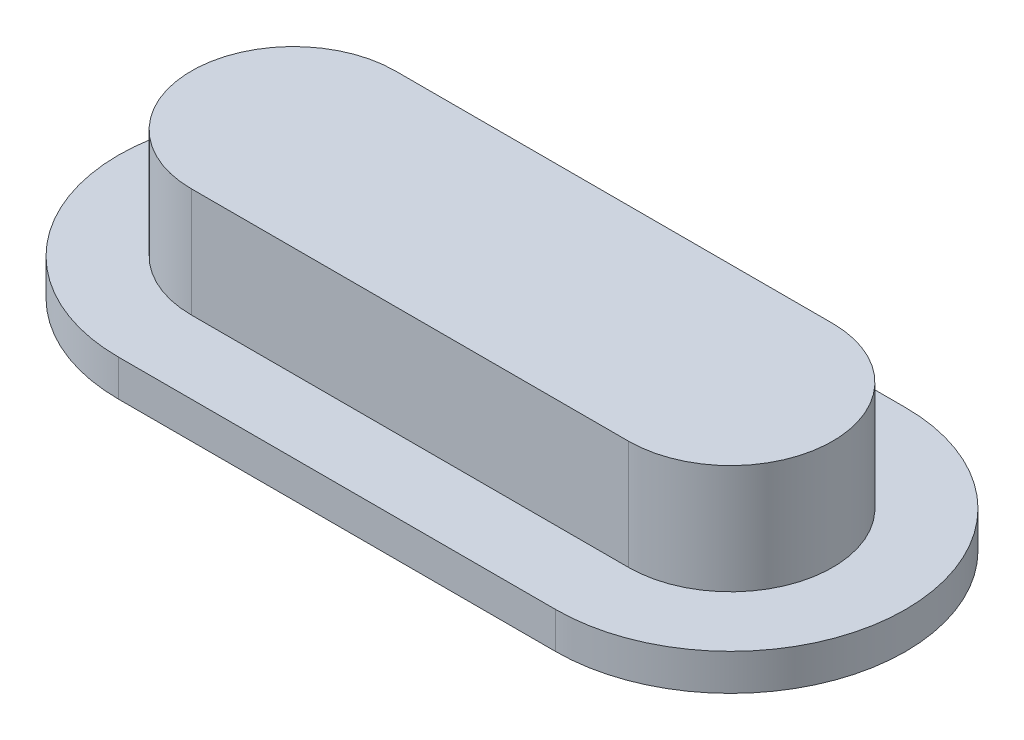
ISO-10303-21;
HEADER;
FILE_DESCRIPTION(('STEP AP214'),'2;1');
FILE_NAME('part.step','',(''),(''),'','','');
FILE_SCHEMA(('AUTOMOTIVE_DESIGN { 1 0 10303 214 1 1 1 1 }'));
ENDSEC;
DATA;
#1=APPLICATION_CONTEXT('core data for automotive mechanical design processes');
#2=APPLICATION_PROTOCOL_DEFINITION('international standard','automotive_design',2000,#1);
#3=PRODUCT_CONTEXT('',#1,'mechanical');
#4=PRODUCT('Part','Part','',(#3));
#5=PRODUCT_RELATED_PRODUCT_CATEGORY('part','',(#4));
#6=PRODUCT_DEFINITION_FORMATION('','',#4);
#7=PRODUCT_DEFINITION_CONTEXT('part definition',#1,'design');
#8=PRODUCT_DEFINITION('design','',#6,#7);
#9=PRODUCT_DEFINITION_SHAPE('','',#8);
#10=(LENGTH_UNIT() NAMED_UNIT(*) SI_UNIT(.MILLI.,.METRE.));
#11=(NAMED_UNIT(*) PLANE_ANGLE_UNIT() SI_UNIT($,.RADIAN.));
#12=(NAMED_UNIT(*) SI_UNIT($,.STERADIAN.) SOLID_ANGLE_UNIT());
#13=UNCERTAINTY_MEASURE_WITH_UNIT(LENGTH_MEASURE(1.E-05),#10,'distance_accuracy_value','');
#14=(GEOMETRIC_REPRESENTATION_CONTEXT(3) GLOBAL_UNCERTAINTY_ASSIGNED_CONTEXT((#13)) GLOBAL_UNIT_ASSIGNED_CONTEXT((#10,
#11,#12)) REPRESENTATION_CONTEXT('',''));
#15=CARTESIAN_POINT('',(0.,0.,0.));
#16=DIRECTION('',(0.,0.,1.));
#17=DIRECTION('',(1.,0.,0.));
#18=AXIS2_PLACEMENT_3D('',#15,#16,#17);
#19=CARTESIAN_POINT('',(-3.,1.5,0.));
#20=DIRECTION('',(0.,-1.,0.));
#21=DIRECTION('',(0.,0.,-1.));
#22=AXIS2_PLACEMENT_3D('',#19,#20,#21);
#23=CYLINDRICAL_SURFACE('',#22,1.4);
#24=CARTESIAN_POINT('',(-3.,0.,0.));
#25=DIRECTION('',(0.,1.,0.));
#26=DIRECTION('',(0.,0.,1.));
#27=AXIS2_PLACEMENT_3D('',#24,#25,#26);
#28=CIRCLE('',#27,1.4);
#29=CARTESIAN_POINT('',(-3.,0.,-1.4));
#30=VERTEX_POINT('',#29);
#31=CARTESIAN_POINT('',(-3.,0.,1.4));
#32=VERTEX_POINT('',#31);
#33=EDGE_CURVE('E120',#30,#32,#28,.T.);
#34=ORIENTED_EDGE('',*,*,#33,.T.);
#35=DIRECTION('',(0.,-1.,0.));
#36=VECTOR('',#35,1.);
#37=CARTESIAN_POINT('',(-3.,1.5,1.4));
#38=LINE('',#37,#36);
#39=CARTESIAN_POINT('',(-3.,1.5,1.4));
#40=VERTEX_POINT('',#39);
#41=EDGE_CURVE('E11',#40,#32,#38,.T.);
#42=ORIENTED_EDGE('',*,*,#41,.F.);
#43=CARTESIAN_POINT('',(-3.,1.5,0.));
#44=DIRECTION('',(0.,1.,0.));
#45=DIRECTION('',(0.,0.,1.));
#46=AXIS2_PLACEMENT_3D('',#43,#44,#45);
#47=CIRCLE('',#46,1.4);
#48=CARTESIAN_POINT('',(-3.,1.5,-1.4));
#49=VERTEX_POINT('',#48);
#50=EDGE_CURVE('E129',#49,#40,#47,.T.);
#51=ORIENTED_EDGE('',*,*,#50,.F.);
#52=DIRECTION('',(0.,-1.,0.));
#53=VECTOR('',#52,1.);
#54=CARTESIAN_POINT('',(-3.,1.5,-1.4));
#55=LINE('',#54,#53);
#56=EDGE_CURVE('E136',#49,#30,#55,.T.);
#57=ORIENTED_EDGE('',*,*,#56,.T.);
#58=EDGE_LOOP('',(#34,#42,#51,#57));
#59=FACE_BOUND('',#58,.T.);
#60=ADVANCED_FACE('F35',(#59),#23,.T.);
#61=CARTESIAN_POINT('',(-3.,1.5,1.4));
#62=DIRECTION('',(0.,0.,-1.));
#63=DIRECTION('',(-1.,0.,0.));
#64=AXIS2_PLACEMENT_3D('',#61,#62,#63);
#65=PLANE('',#64);
#66=DIRECTION('',(1.,0.,0.));
#67=VECTOR('',#66,1.);
#68=CARTESIAN_POINT('',(-3.,0.,1.4));
#69=LINE('',#68,#67);
#70=CARTESIAN_POINT('',(3.,0.,1.4));
#71=VERTEX_POINT('',#70);
#72=EDGE_CURVE('E123',#32,#71,#69,.T.);
#73=ORIENTED_EDGE('',*,*,#72,.T.);
#74=DIRECTION('',(0.,-1.,0.));
#75=VECTOR('',#74,1.);
#76=CARTESIAN_POINT('',(3.,1.5,1.4));
#77=LINE('',#76,#75);
#78=CARTESIAN_POINT('',(3.,1.5,1.4));
#79=VERTEX_POINT('',#78);
#80=EDGE_CURVE('E43',#79,#71,#77,.T.);
#81=ORIENTED_EDGE('',*,*,#80,.F.);
#82=DIRECTION('',(1.,0.,0.));
#83=VECTOR('',#82,1.);
#84=CARTESIAN_POINT('',(-3.,1.5,1.4));
#85=LINE('',#84,#83);
#86=EDGE_CURVE('E131',#40,#79,#85,.T.);
#87=ORIENTED_EDGE('',*,*,#86,.F.);
#88=ORIENTED_EDGE('',*,*,#41,.T.);
#89=EDGE_LOOP('',(#73,#81,#87,#88));
#90=FACE_BOUND('',#89,.T.);
#91=ADVANCED_FACE('F157',(#90),#65,.F.);
#92=CARTESIAN_POINT('',(3.,1.5,0.));
#93=DIRECTION('',(0.,-1.,0.));
#94=DIRECTION('',(0.,0.,-1.));
#95=AXIS2_PLACEMENT_3D('',#92,#93,#94);
#96=CYLINDRICAL_SURFACE('',#95,1.4);
#97=CARTESIAN_POINT('',(3.,0.,0.));
#98=DIRECTION('',(0.,1.,0.));
#99=DIRECTION('',(0.,0.,1.));
#100=AXIS2_PLACEMENT_3D('',#97,#98,#99);
#101=CIRCLE('',#100,1.4);
#102=CARTESIAN_POINT('',(3.,0.,-1.4));
#103=VERTEX_POINT('',#102);
#104=EDGE_CURVE('E140',#71,#103,#101,.T.);
#105=ORIENTED_EDGE('',*,*,#104,.T.);
#106=DIRECTION('',(0.,-1.,0.));
#107=VECTOR('',#106,1.);
#108=CARTESIAN_POINT('',(3.,1.5,-1.4));
#109=LINE('',#108,#107);
#110=CARTESIAN_POINT('',(3.,1.5,-1.4));
#111=VERTEX_POINT('',#110);
#112=EDGE_CURVE('E147',#111,#103,#109,.T.);
#113=ORIENTED_EDGE('',*,*,#112,.F.);
#114=CARTESIAN_POINT('',(3.,1.5,0.));
#115=DIRECTION('',(0.,1.,0.));
#116=DIRECTION('',(0.,0.,1.));
#117=AXIS2_PLACEMENT_3D('',#114,#115,#116);
#118=CIRCLE('',#117,1.4);
#119=EDGE_CURVE('E134',#79,#111,#118,.T.);
#120=ORIENTED_EDGE('',*,*,#119,.F.);
#121=ORIENTED_EDGE('',*,*,#80,.T.);
#122=EDGE_LOOP('',(#105,#113,#120,#121));
#123=FACE_BOUND('',#122,.T.);
#124=ADVANCED_FACE('F153',(#123),#96,.T.);
#125=CARTESIAN_POINT('',(-3.,1.5,-1.4));
#126=DIRECTION('',(0.,0.,1.));
#127=DIRECTION('',(1.,0.,0.));
#128=AXIS2_PLACEMENT_3D('',#125,#126,#127);
#129=PLANE('',#128);
#130=DIRECTION('',(-1.,0.,0.));
#131=VECTOR('',#130,1.);
#132=CARTESIAN_POINT('',(-3.,0.,-1.4));
#133=LINE('',#132,#131);
#134=EDGE_CURVE('E132',#103,#30,#133,.T.);
#135=ORIENTED_EDGE('',*,*,#134,.T.);
#136=ORIENTED_EDGE('',*,*,#56,.F.);
#137=DIRECTION('',(-1.,0.,0.));
#138=VECTOR('',#137,1.);
#139=CARTESIAN_POINT('',(-3.,1.5,-1.4));
#140=LINE('',#139,#138);
#141=EDGE_CURVE('E50',#111,#49,#140,.T.);
#142=ORIENTED_EDGE('',*,*,#141,.F.);
#143=ORIENTED_EDGE('',*,*,#112,.T.);
#144=EDGE_LOOP('',(#135,#136,#142,#143));
#145=FACE_BOUND('',#144,.T.);
#146=ADVANCED_FACE('F163',(#145),#129,.F.);
#147=CARTESIAN_POINT('',(-3.,1.5,0.));
#148=DIRECTION('',(0.,1.,0.));
#149=DIRECTION('',(0.,0.,1.));
#150=AXIS2_PLACEMENT_3D('',#147,#148,#149);
#151=PLANE('',#150);
#152=ORIENTED_EDGE('',*,*,#50,.T.);
#153=ORIENTED_EDGE('',*,*,#86,.T.);
#154=ORIENTED_EDGE('',*,*,#119,.T.);
#155=ORIENTED_EDGE('',*,*,#141,.T.);
#156=EDGE_LOOP('',(#152,#153,#154,#155));
#157=FACE_BOUND('',#156,.T.);
#158=ADVANCED_FACE('F166',(#157),#151,.T.);
#159=CARTESIAN_POINT('',(-3.,-0.5,0.));
#160=DIRECTION('',(0.,1.,0.));
#161=DIRECTION('',(0.,0.,1.));
#162=AXIS2_PLACEMENT_3D('',#159,#160,#161);
#163=CYLINDRICAL_SURFACE('',#162,2.4);
#164=CARTESIAN_POINT('',(-3.,0.,0.));
#165=DIRECTION('',(0.,-1.,0.));
#166=DIRECTION('',(0.,0.,-1.));
#167=AXIS2_PLACEMENT_3D('',#164,#165,#166);
#168=CIRCLE('',#167,2.4);
#169=CARTESIAN_POINT('',(-3.,0.,2.4));
#170=VERTEX_POINT('',#169);
#171=CARTESIAN_POINT('',(-3.,0.,-2.4));
#172=VERTEX_POINT('',#171);
#173=EDGE_CURVE('E119',#170,#172,#168,.T.);
#174=ORIENTED_EDGE('',*,*,#173,.T.);
#175=DIRECTION('',(0.,1.,0.));
#176=VECTOR('',#175,1.);
#177=CARTESIAN_POINT('',(-3.,-0.5,-2.4));
#178=LINE('',#177,#176);
#179=CARTESIAN_POINT('',(-3.,-0.5,-2.4));
#180=VERTEX_POINT('',#179);
#181=EDGE_CURVE('E99',#180,#172,#178,.T.);
#182=ORIENTED_EDGE('',*,*,#181,.F.);
#183=CARTESIAN_POINT('',(-3.,-0.5,0.));
#184=DIRECTION('',(0.,-1.,0.));
#185=DIRECTION('',(0.,0.,-1.));
#186=AXIS2_PLACEMENT_3D('',#183,#184,#185);
#187=CIRCLE('',#186,2.4);
#188=CARTESIAN_POINT('',(-3.,-0.5,2.4));
#189=VERTEX_POINT('',#188);
#190=EDGE_CURVE('E106',#189,#180,#187,.T.);
#191=ORIENTED_EDGE('',*,*,#190,.F.);
#192=DIRECTION('',(0.,1.,0.));
#193=VECTOR('',#192,1.);
#194=CARTESIAN_POINT('',(-3.,-0.5,2.4));
#195=LINE('',#194,#193);
#196=EDGE_CURVE('E246',#189,#170,#195,.T.);
#197=ORIENTED_EDGE('',*,*,#196,.T.);
#198=EDGE_LOOP('',(#174,#182,#191,#197));
#199=FACE_BOUND('',#198,.T.);
#200=ADVANCED_FACE('F117',(#199),#163,.T.);
#201=CARTESIAN_POINT('',(-3.,-0.5,-2.4));
#202=DIRECTION('',(0.,0.,1.));
#203=DIRECTION('',(1.,0.,0.));
#204=AXIS2_PLACEMENT_3D('',#201,#202,#203);
#205=PLANE('',#204);
#206=DIRECTION('',(1.,0.,0.));
#207=VECTOR('',#206,1.);
#208=CARTESIAN_POINT('',(-3.,0.,-2.4));
#209=LINE('',#208,#207);
#210=CARTESIAN_POINT('',(3.,0.,-2.4));
#211=VERTEX_POINT('',#210);
#212=EDGE_CURVE('E252',#172,#211,#209,.T.);
#213=ORIENTED_EDGE('',*,*,#212,.T.);
#214=DIRECTION('',(0.,1.,0.));
#215=VECTOR('',#214,1.);
#216=CARTESIAN_POINT('',(3.,-0.5,-2.4));
#217=LINE('',#216,#215);
#218=CARTESIAN_POINT('',(3.,-0.5,-2.4));
#219=VERTEX_POINT('',#218);
#220=EDGE_CURVE('E102',#219,#211,#217,.T.);
#221=ORIENTED_EDGE('',*,*,#220,.F.);
#222=DIRECTION('',(1.,0.,0.));
#223=VECTOR('',#222,1.);
#224=CARTESIAN_POINT('',(-3.,-0.5,-2.4));
#225=LINE('',#224,#223);
#226=EDGE_CURVE('E95',#180,#219,#225,.T.);
#227=ORIENTED_EDGE('',*,*,#226,.F.);
#228=ORIENTED_EDGE('',*,*,#181,.T.);
#229=EDGE_LOOP('',(#213,#221,#227,#228));
#230=FACE_BOUND('',#229,.T.);
#231=ADVANCED_FACE('F97',(#230),#205,.F.);
#232=CARTESIAN_POINT('',(3.,-0.5,0.));
#233=DIRECTION('',(0.,1.,0.));
#234=DIRECTION('',(0.,0.,1.));
#235=AXIS2_PLACEMENT_3D('',#232,#233,#234);
#236=CYLINDRICAL_SURFACE('',#235,2.4);
#237=CARTESIAN_POINT('',(3.,0.,0.));
#238=DIRECTION('',(0.,-1.,0.));
#239=DIRECTION('',(0.,0.,-1.));
#240=AXIS2_PLACEMENT_3D('',#237,#238,#239);
#241=CIRCLE('',#240,2.4);
#242=CARTESIAN_POINT('',(3.,0.,2.4));
#243=VERTEX_POINT('',#242);
#244=EDGE_CURVE('E249',#211,#243,#241,.T.);
#245=ORIENTED_EDGE('',*,*,#244,.T.);
#246=DIRECTION('',(0.,1.,0.));
#247=VECTOR('',#246,1.);
#248=CARTESIAN_POINT('',(3.,-0.5,2.4));
#249=LINE('',#248,#247);
#250=CARTESIAN_POINT('',(3.,-0.5,2.4));
#251=VERTEX_POINT('',#250);
#252=EDGE_CURVE('E125',#251,#243,#249,.T.);
#253=ORIENTED_EDGE('',*,*,#252,.F.);
#254=CARTESIAN_POINT('',(3.,-0.5,0.));
#255=DIRECTION('',(0.,-1.,0.));
#256=DIRECTION('',(0.,0.,-1.));
#257=AXIS2_PLACEMENT_3D('',#254,#255,#256);
#258=CIRCLE('',#257,2.4);
#259=EDGE_CURVE('E105',#219,#251,#258,.T.);
#260=ORIENTED_EDGE('',*,*,#259,.F.);
#261=ORIENTED_EDGE('',*,*,#220,.T.);
#262=EDGE_LOOP('',(#245,#253,#260,#261));
#263=FACE_BOUND('',#262,.T.);
#264=ADVANCED_FACE('F205',(#263),#236,.T.);
#265=CARTESIAN_POINT('',(3.,-0.5,2.4));
#266=DIRECTION('',(0.,0.,-1.));
#267=DIRECTION('',(-1.,0.,0.));
#268=AXIS2_PLACEMENT_3D('',#265,#266,#267);
#269=PLANE('',#268);
#270=DIRECTION('',(-1.,0.,0.));
#271=VECTOR('',#270,1.);
#272=CARTESIAN_POINT('',(3.,0.,2.4));
#273=LINE('',#272,#271);
#274=EDGE_CURVE('E115',#243,#170,#273,.T.);
#275=ORIENTED_EDGE('',*,*,#274,.T.);
#276=ORIENTED_EDGE('',*,*,#196,.F.);
#277=DIRECTION('',(-1.,0.,0.));
#278=VECTOR('',#277,1.);
#279=CARTESIAN_POINT('',(3.,-0.5,2.4));
#280=LINE('',#279,#278);
#281=EDGE_CURVE('E111',#251,#189,#280,.T.);
#282=ORIENTED_EDGE('',*,*,#281,.F.);
#283=ORIENTED_EDGE('',*,*,#252,.T.);
#284=EDGE_LOOP('',(#275,#276,#282,#283));
#285=FACE_BOUND('',#284,.T.);
#286=ADVANCED_FACE('F214',(#285),#269,.F.);
#287=CARTESIAN_POINT('',(-3.,-0.5,0.));
#288=DIRECTION('',(0.,-1.,0.));
#289=DIRECTION('',(0.,0.,-1.));
#290=AXIS2_PLACEMENT_3D('',#287,#288,#289);
#291=PLANE('',#290);
#292=ORIENTED_EDGE('',*,*,#190,.T.);
#293=ORIENTED_EDGE('',*,*,#226,.T.);
#294=ORIENTED_EDGE('',*,*,#259,.T.);
#295=ORIENTED_EDGE('',*,*,#281,.T.);
#296=EDGE_LOOP('',(#292,#293,#294,#295));
#297=FACE_BOUND('',#296,.T.);
#298=ADVANCED_FACE('F109',(#297),#291,.T.);
#299=CARTESIAN_POINT('',(-3.,0.,0.));
#300=DIRECTION('',(0.,-1.,0.));
#301=DIRECTION('',(0.,0.,-1.));
#302=AXIS2_PLACEMENT_3D('',#299,#300,#301);
#303=PLANE('',#302);
#304=ORIENTED_EDGE('',*,*,#33,.F.);
#305=ORIENTED_EDGE('',*,*,#134,.F.);
#306=ORIENTED_EDGE('',*,*,#104,.F.);
#307=ORIENTED_EDGE('',*,*,#72,.F.);
#308=EDGE_LOOP('',(#304,#305,#306,#307));
#309=FACE_BOUND('',#308,.T.);
#310=ORIENTED_EDGE('',*,*,#173,.F.);
#311=ORIENTED_EDGE('',*,*,#274,.F.);
#312=ORIENTED_EDGE('',*,*,#244,.F.);
#313=ORIENTED_EDGE('',*,*,#212,.F.);
#314=EDGE_LOOP('',(#310,#311,#312,#313));
#315=FACE_BOUND('',#314,.T.);
#316=ADVANCED_FACE('F160',(#309,#315),#303,.F.);
#317=CLOSED_SHELL('',(#60,#91,#124,#146,#158,#200,#231,#264,#286,#298,#316));
#318=MANIFOLD_SOLID_BREP('B2',#317);
#319=ADVANCED_BREP_SHAPE_REPRESENTATION('',(#18,#318),#14);
#320=SHAPE_DEFINITION_REPRESENTATION(#9,#319);
ENDSEC;
END-ISO-10303-21;
